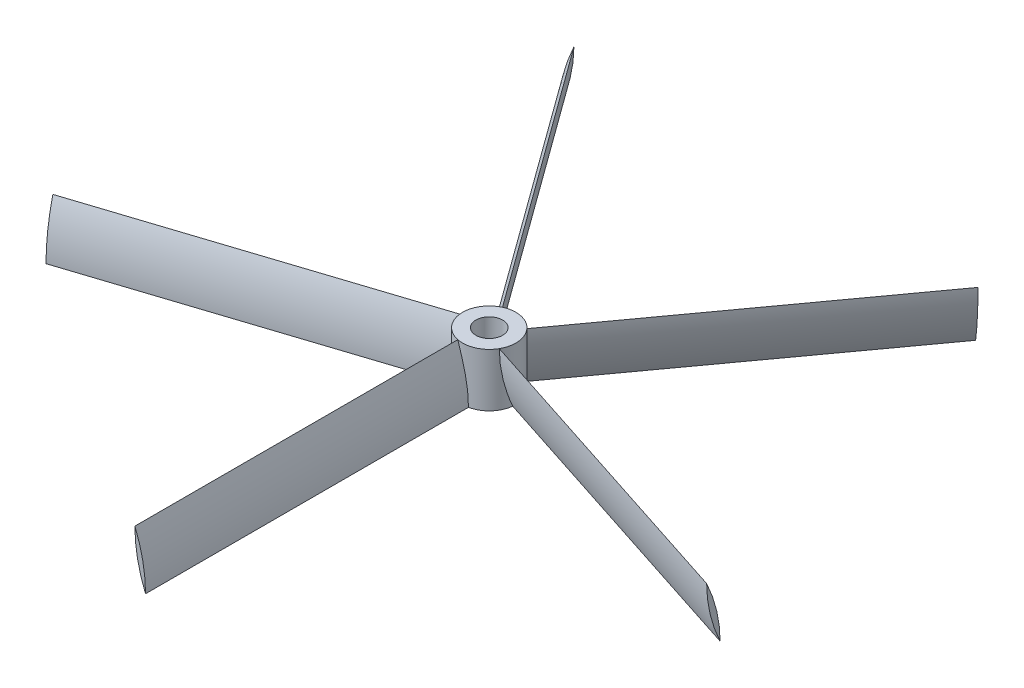
ISO-10303-21;
HEADER;
FILE_DESCRIPTION(('STEP AP214'),'2;1');
FILE_NAME('part.step','',(''),(''),'','','');
FILE_SCHEMA(('AUTOMOTIVE_DESIGN { 1 0 10303 214 1 1 1 1 }'));
ENDSEC;
DATA;
#1=APPLICATION_CONTEXT('core data for automotive mechanical design processes');
#2=APPLICATION_PROTOCOL_DEFINITION('international standard','automotive_design',2000,#1);
#3=PRODUCT_CONTEXT('',#1,'mechanical');
#4=PRODUCT('Part','Part','',(#3));
#5=PRODUCT_RELATED_PRODUCT_CATEGORY('part','',(#4));
#6=PRODUCT_DEFINITION_FORMATION('','',#4);
#7=PRODUCT_DEFINITION_CONTEXT('part definition',#1,'design');
#8=PRODUCT_DEFINITION('design','',#6,#7);
#9=PRODUCT_DEFINITION_SHAPE('','',#8);
#10=(LENGTH_UNIT() NAMED_UNIT(*) SI_UNIT(.MILLI.,.METRE.));
#11=(NAMED_UNIT(*) PLANE_ANGLE_UNIT() SI_UNIT($,.RADIAN.));
#12=(NAMED_UNIT(*) SI_UNIT($,.STERADIAN.) SOLID_ANGLE_UNIT());
#13=UNCERTAINTY_MEASURE_WITH_UNIT(LENGTH_MEASURE(1.E-05),#10,'distance_accuracy_value','');
#14=(GEOMETRIC_REPRESENTATION_CONTEXT(3) GLOBAL_UNCERTAINTY_ASSIGNED_CONTEXT((#13)) GLOBAL_UNIT_ASSIGNED_CONTEXT((#10,
#11,#12)) REPRESENTATION_CONTEXT('',''));
#15=CARTESIAN_POINT('',(0.,0.,0.));
#16=DIRECTION('',(0.,0.,1.));
#17=DIRECTION('',(1.,0.,0.));
#18=AXIS2_PLACEMENT_3D('',#15,#16,#17);
#19=CARTESIAN_POINT('',(0.,10.,0.));
#20=DIRECTION('',(0.,-1.,0.));
#21=DIRECTION('',(0.,0.,-1.));
#22=AXIS2_PLACEMENT_3D('',#19,#20,#21);
#23=CYLINDRICAL_SURFACE('',#22,5.);
#24=CARTESIAN_POINT('',(-4.35018936856919,0.,2.46492443242944));
#25=CARTESIAN_POINT('',(-4.35018576242669,0.183122408193911,2.46492327211694));
#26=CARTESIAN_POINT('',(-4.35116329032223,0.366238966577232,2.46320659108679));
#27=CARTESIAN_POINT('',(-4.35504861769024,0.732385126654451,2.45633344970384));
#28=CARTESIAN_POINT('',(-4.35795639685755,0.915414729242806,2.45117702553521));
#29=CARTESIAN_POINT('',(-4.36952652783202,1.46423654088765,2.43053608567267));
#30=CARTESIAN_POINT('',(-4.3810356828564,1.82979126387575,2.40987990521031));
#31=CARTESIAN_POINT('',(-4.41100473200378,2.56002603892125,2.35457445252717));
#32=CARTESIAN_POINT('',(-4.42947377498104,2.92470430108329,2.31990675763802));
#33=CARTESIAN_POINT('',(-4.47226728840418,3.65207369386719,2.23629846711075));
#34=CARTESIAN_POINT('',(-4.49659168812454,4.01476484843675,2.18735804386812));
#35=CARTESIAN_POINT('',(-4.54912950127679,4.73094342097573,2.07584844477526));
#36=CARTESIAN_POINT('',(-4.57726379887104,5.08447797468368,2.01354442228804));
#37=CARTESIAN_POINT('',(-4.63599991386565,5.78845761718897,1.87435626582235));
#38=CARTESIAN_POINT('',(-4.66660168189557,6.13890276764517,1.79747242352305));
#39=CARTESIAN_POINT('',(-4.72815660226076,6.83573916802041,1.62867946904067));
#40=CARTESIAN_POINT('',(-4.75910935682641,7.18213424879246,1.53678603815932));
#41=CARTESIAN_POINT('',(-4.81896112487492,7.87051902716679,1.3373339739789));
#42=CARTESIAN_POINT('',(-4.84786061668544,8.21250973551101,1.22977900710991));
#43=CARTESIAN_POINT('',(-4.88380287649291,8.67383406860872,1.07251073141029));
#44=CARTESIAN_POINT('',(-4.89298665612179,8.7954458951682,1.02988631705044));
#45=CARTESIAN_POINT('',(-4.91056720210785,9.03794972524256,0.942506075061072));
#46=CARTESIAN_POINT('',(-4.91896403569518,9.1588417894201,0.897750429999793));
#47=CARTESIAN_POINT('',(-4.93484128986999,9.40025583629768,0.805928129437622));
#48=CARTESIAN_POINT('',(-4.94231865626409,9.52077535457646,0.758854462608985));
#49=CARTESIAN_POINT('',(-4.95615400359151,9.76100921267716,0.662496655488868));
#50=CARTESIAN_POINT('',(-4.96251184519309,9.88072345049625,0.61321224101263));
#51=CARTESIAN_POINT('',(-4.9682233573191,10.,0.562811399839151));
#52=B_SPLINE_CURVE_WITH_KNOTS('',3,(#24,#25,#26,#27,#28,#29,#30,#31,#32,#33,#34,#35,#36,#37,#38,
#39,#40,#41,#42,#43,#44,#45,#46,#47,#48,#49,#50,#51),.UNSPECIFIED.,.F.,.F.,(4,2,2,2,2,2,2,2,2,2,
2,2,2,4),(0.,0.549344934541571,1.09868409037402,2.19727394631187,3.29731297760975,
4.39733872245518,5.47727983444197,6.55719934375528,7.63599773777188,8.71454398546223,
9.1021046483874,9.48963217110426,9.87841403301756,10.2672442470775),.UNSPECIFIED.);
#53=CARTESIAN_POINT('',(-4.35018936856919,0.,2.46492443242944));
#54=VERTEX_POINT('',#53);
#55=CARTESIAN_POINT('',(-4.96822335731911,10.,0.56281139983914));
#56=VERTEX_POINT('',#55);
#57=EDGE_CURVE('E142',#54,#56,#52,.T.);
#58=ORIENTED_EDGE('',*,*,#57,.F.);
#59=CARTESIAN_POINT('',(0.,0.,0.));
#60=DIRECTION('',(0.,1.,0.));
#61=DIRECTION('',(0.,0.,1.));
#62=AXIS2_PLACEMENT_3D('',#59,#60,#61);
#63=CIRCLE('',#62,5.);
#64=CARTESIAN_POINT('',(0.999999999999997,0.,4.89897948556636));
#65=VERTEX_POINT('',#64);
#66=EDGE_CURVE('E393',#54,#65,#63,.T.);
#67=ORIENTED_EDGE('',*,*,#66,.T.);
#68=CARTESIAN_POINT('',(-1.,10.,4.89897948556636));
#69=CARTESIAN_POINT('',(-1.00000001083655,9.81687759180609,4.89897569736476));
#70=CARTESIAN_POINT('',(-0.998065277424227,9.63376103342277,4.89937489802743));
#71=CARTESIAN_POINT('',(-0.990327899339134,9.26761487334555,4.90094614644664));
#72=CARTESIAN_POINT('',(-0.984525295354193,9.0845852707572,4.90211818607334));
#73=CARTESIAN_POINT('',(-0.961319227897217,8.53576345911235,4.90674363333361));
#74=CARTESIAN_POINT('',(-0.938117508373282,8.17020873612425,4.91130637941485));
#75=CARTESIAN_POINT('',(-0.876257951720518,7.43997396107875,4.92271831413295));
#76=CARTESIAN_POINT('',(-0.837579766441451,7.07529569891671,4.92957051092965));
#77=CARTESIAN_POINT('',(-0.744839634022431,6.34792630613281,4.94443317808232));
#78=CARTESIAN_POINT('',(-0.690777872695728,5.98523515156324,4.95244363444747));
#79=CARTESIAN_POINT('',(-0.568490864737664,5.26905657902427,4.96795170284218));
#80=CARTESIAN_POINT('',(-0.500542242078362,4.91552202531632,4.9754560081341));
#81=CARTESIAN_POINT('',(-0.350015981163668,4.21154238281102,4.98830586727798));
#82=CARTESIAN_POINT('',(-0.267438635567945,3.86109723235483,4.99365146430966));
#83=CARTESIAN_POINT('',(-0.0878854798225153,3.16426083197959,5.00003378096719));
#84=CARTESIAN_POINT('',(0.00907529360542183,2.81786575120754,5.00107496808037));
#85=CARTESIAN_POINT('',(0.217260692403102,2.12948097283321,4.99636330469978));
#86=CARTESIAN_POINT('',(0.328481978602005,1.78749026448899,4.99061204211184));
#87=CARTESIAN_POINT('',(0.489159766109385,1.32616593139128,4.97619659264488));
#88=CARTESIAN_POINT('',(0.532535937117506,1.2045541048318,4.97175921769267));
#89=CARTESIAN_POINT('',(0.621072173137027,0.962050274757444,4.96147733076543));
#90=CARTESIAN_POINT('',(0.666232085290968,0.84115821057991,4.95563293914675));
#91=CARTESIAN_POINT('',(0.758466623945855,0.599744163702327,4.94235845385427));
#92=CARTESIAN_POINT('',(0.80554697481808,0.479224645423545,4.9349232888505));
#93=CARTESIAN_POINT('',(0.901464052622833,0.23899078732285,4.91830528614063));
#94=CARTESIAN_POINT('',(0.950300997264684,0.119276549503763,4.90912223119442));
#95=CARTESIAN_POINT('',(0.999999999999996,0.,4.89897948556636));
#96=B_SPLINE_CURVE_WITH_KNOTS('',3,(#68,#69,#70,#71,#72,#73,#74,#75,#76,#77,#78,#79,#80,#81,#82,
#83,#84,#85,#86,#87,#88,#89,#90,#91,#92,#93,#94,#95),.UNSPECIFIED.,.F.,.F.,(4,2,2,2,2,2,2,2,2,2,
2,2,2,4),(0.,0.549344934541571,1.09868409037402,2.19727394631186,3.29731297760975,
4.39733872245518,5.47727983444197,6.55719934375529,7.63599773777188,8.71454398546223,
9.10210464838739,9.48963217110426,9.87841403301756,10.2672442470775),.UNSPECIFIED.);
#97=CARTESIAN_POINT('',(-1.,10.,4.89897948556636));
#98=VERTEX_POINT('',#97);
#99=EDGE_CURVE('E53',#98,#65,#96,.T.);
#100=ORIENTED_EDGE('',*,*,#99,.F.);
#101=CARTESIAN_POINT('',(0.,10.,0.));
#102=DIRECTION('',(0.,1.,0.));
#103=DIRECTION('',(0.,0.,1.));
#104=AXIS2_PLACEMENT_3D('',#101,#102,#103);
#105=CIRCLE('',#104,5.);
#106=EDGE_CURVE('E233',#56,#98,#105,.T.);
#107=ORIENTED_EDGE('',*,*,#106,.F.);
#108=EDGE_LOOP('',(#58,#67,#100,#107));
#109=FACE_BOUND('',#108,.T.);
#110=ADVANCED_FACE('F39',(#109),#23,.T.);
#111=CARTESIAN_POINT('',(-4.96822335731911,10.,0.56281139983914));
#112=CARTESIAN_POINT('',(-4.96821975787397,9.81687759180609,0.562810218914301));
#113=CARTESIAN_POINT('',(-4.96800155476152,9.63376103342277,0.564773619522319));
#114=CARTESIAN_POINT('',(-4.96710491948913,9.26761487334555,0.572617845833107));
#115=CARTESIAN_POINT('',(-4.96642649217048,9.0845852707572,0.578498630327197));
#116=CARTESIAN_POINT('',(-4.96365448471132,8.53576345911235,0.601998253809744));
#117=CARTESIAN_POINT('',(-4.96082418847247,8.17020873612425,0.625474366432354));
#118=CARTESIAN_POINT('',(-4.95256192907945,7.43997396107875,0.687832782648684));
#119=CARTESIAN_POINT('',(-4.94712653893108,7.07529569891671,0.726735368055797));
#120=CARTESIAN_POINT('',(-4.93260349839809,6.34792630613281,0.819529292046894));
#121=CARTESIAN_POINT('',(-4.92351589212687,5.98523515156324,0.873420449588577));
#122=CARTESIAN_POINT('',(-4.9004761779785,5.26905657902427,0.994514562049227));
#123=CARTESIAN_POINT('',(-4.88661591728055,4.91552202531632,1.06145650026882));
#124=CARTESIAN_POINT('',(-4.85232168683045,4.21154238281103,1.20858630643607));
#125=CARTESIAN_POINT('',(-4.83188784858146,3.86109723235483,1.2887739093911));
#126=CARTESIAN_POINT('',(-4.78247281590867,3.16426083197959,1.46151135249481));
#127=CARTESIAN_POINT('',(-4.75350051692038,2.81786575120754,1.55404827240076));
#128=CARTESIAN_POINT('',(-4.68468663255047,2.12948097283321,1.75058836846842));
#129=CARTESIAN_POINT('',(-4.64484758921758,1.78749026448899,1.85458885957984));
#130=CARTESIAN_POINT('',(-4.58148551510836,1.32616593139128,2.00294789754577));
#131=CARTESIAN_POINT('',(-4.56386134675239,1.2045541048318,2.04282986336433));
#132=CARTESIAN_POINT('',(-4.5267234896424,0.962050274757444,2.12385554976418));
#133=CARTESIAN_POINT('',(-4.50720996258963,0.841158210579908,2.16499916216155));
#134=CARTESIAN_POINT('',(-4.46608313693905,0.599744163702327,2.2486173796298));
#135=CARTESIAN_POINT('',(-4.44446324629184,0.479224645423546,2.29109586177415));
#136=CARTESIAN_POINT('',(-4.39901857943435,0.238990787322853,2.37718317839443));
#137=CARTESIAN_POINT('',(-4.37519352934058,0.119276549503765,2.42079215279335));
#138=CARTESIAN_POINT('',(-4.35018936856919,0.,2.46492443242944));
#139=B_SPLINE_CURVE_WITH_KNOTS('',3,(#111,#112,#113,#114,#115,#116,#117,#118,#119,#120,#121,
#122,#123,#124,#125,#126,#127,#128,#129,#130,#131,#132,#133,#134,#135,#136,#137,#138),
.UNSPECIFIED.,.F.,.F.,(4,2,2,2,2,2,2,2,2,2,2,2,2,4),(0.,0.549344934541571,1.09868409037402,
2.19727394631187,3.29731297760975,4.39733872245518,5.47727983444197,6.55719934375529,
7.63599773777188,8.71454398546223,9.10210464838739,9.48963217110426,9.87841403301756,
10.2672442470775),.UNSPECIFIED.);
#140=EDGE_CURVE('E60',#56,#54,#139,.T.);
#141=ORIENTED_EDGE('',*,*,#140,.F.);
#142=CARTESIAN_POINT('',(-2.07053089852436,10.,-4.55114291120988));
#143=VERTEX_POINT('',#142);
#144=EDGE_CURVE('E384',#143,#56,#105,.T.);
#145=ORIENTED_EDGE('',*,*,#144,.F.);
#146=CARTESIAN_POINT('',(-3.68856488727425,0.,-3.37557240662492));
#147=CARTESIAN_POINT('',(-3.68856266939217,0.183122408193911,-3.37556933553588));
#148=CARTESIAN_POINT('',(-3.68723208144424,0.366238966577233,-3.37702950342303));
#149=CARTESIAN_POINT('',(-3.68189596772999,0.732385126654451,-3.38284858682639));
#150=CARTESIAN_POINT('',(-3.67789047010222,0.915414729242806,-3.38720747184971));
#151=CARTESIAN_POINT('',(-3.66183513684176,1.46423654088765,-3.40458972150477));
#152=CARTESIAN_POINT('',(-3.64574646630468,1.82979126387575,-3.4219186891895));
#153=CARTESIAN_POINT('',(-3.60240880063552,2.56002603892125,-3.46751127342899));
#154=CARTESIAN_POINT('',(-3.57514511165608,2.92470430108329,-3.49578928397879));
#155=CARTESIAN_POINT('',(-3.50885282503059,3.65207369386719,-3.56232471641859));
#156=CARTESIAN_POINT('',(-3.46982436948701,4.01476484843676,-3.60058201777149));
#157=CARTESIAN_POINT('',(-3.38000751575163,4.73094342097573,-3.68500680847746));
#158=CARTESIAN_POINT('',(-3.32944684525517,5.08447797468368,-3.73101711730232));
#159=CARTESIAN_POINT('',(-3.21522149977427,5.78845761718898,-3.82988998797343));
#160=CARTESIAN_POINT('',(-3.15155708693688,6.13890276764517,-3.88275241273177));
#161=CARTESIAN_POINT('',(-3.01004696415194,6.83573916802041,-3.99345451232093));
#162=CARTESIAN_POINT('',(-2.932216045091,7.18213424879246,-4.05128896306163));
#163=CARTESIAN_POINT('',(-2.76102107323408,7.87051902716679,-4.16984545447086));
#164=CARTESIAN_POINT('',(-2.66766065523168,8.21250973551101,-4.23056681706683));
#165=CARTESIAN_POINT('',(-2.52919640591779,8.67383406860872,-4.31334850733432));
#166=CARTESIAN_POINT('',(-2.4914961228655,8.7954458951682,-4.33525446920706));
#167=CARTESIAN_POINT('',(-2.41382526180615,9.03794972524256,-4.37897654177444));
#168=CARTESIAN_POINT('',(-2.37385487820705,9.15884178942009,-4.40079265999206));
#169=CARTESIAN_POINT('',(-2.29143302228022,9.40025583629768,-4.4442674773722));
#170=CARTESIAN_POINT('',(-2.24897393798588,9.52077535457646,-4.46592543844363));
#171=CARTESIAN_POINT('',(-2.16160757507563,9.76100921267716,-4.5088598356154));
#172=CARTESIAN_POINT('',(-2.11669999263865,9.88072345049625,-4.53013622393114));
#173=CARTESIAN_POINT('',(-2.07053089852437,10.,-4.55114291120987));
#174=B_SPLINE_CURVE_WITH_KNOTS('',3,(#146,#147,#148,#149,#150,#151,#152,#153,#154,#155,#156,
#157,#158,#159,#160,#161,#162,#163,#164,#165,#166,#167,#168,#169,#170,#171,#172,#173),
.UNSPECIFIED.,.F.,.F.,(4,2,2,2,2,2,2,2,2,2,2,2,2,4),(0.,0.549344934541571,1.09868409037402,
2.19727394631187,3.29731297760975,4.39733872245518,5.47727983444197,6.55719934375529,
7.63599773777188,8.71454398546223,9.10210464838739,9.48963217110426,9.87841403301756,
10.2672442470775),.UNSPECIFIED.);
#175=CARTESIAN_POINT('',(-3.68856488727425,0.,-3.37557240662492));
#176=VERTEX_POINT('',#175);
#177=EDGE_CURVE('E318',#176,#143,#174,.T.);
#178=ORIENTED_EDGE('',*,*,#177,.F.);
#179=EDGE_CURVE('E382',#176,#54,#63,.T.);
#180=ORIENTED_EDGE('',*,*,#179,.T.);
#181=EDGE_LOOP('',(#141,#145,#178,#180));
#182=FACE_BOUND('',#181,.T.);
#183=ADVANCED_FACE('F182',(#182),#23,.T.);
#184=CARTESIAN_POINT('',(-2.07053089852436,10.,-4.55114291120988));
#185=CARTESIAN_POINT('',(-2.07052866310837,9.81687759180609,-4.55113985285997));
#186=CARTESIAN_POINT('',(-2.07232853958076,9.63376103342277,-4.55032560521336));
#187=CARTESIAN_POINT('',(-2.079511766592,9.26761487334555,-4.54704885515705));
#188=CARTESIAN_POINT('',(-2.08489507943513,9.0845852707572,-4.54458637008589));
#189=CARTESIAN_POINT('',(-2.10638795206528,8.53576345911235,-4.53468825131111));
#190=CARTESIAN_POINT('',(-2.12784045231536,8.17020873612425,-4.52474196186786));
#191=CARTESIAN_POINT('',(-2.18459365183937,7.43997396107875,-4.49761427587966));
#192=CARTESIAN_POINT('',(-2.21991258126463,7.07529569891671,-4.48042335264452));
#193=CARTESIAN_POINT('',(-2.30367698101427,6.34792630613281,-4.43793622082122));
#194=CARTESIAN_POINT('',(-2.35212229278898,5.98523515156324,-4.41264011013253));
#195=CARTESIAN_POINT('',(-2.46016997431227,5.26905657902427,-4.35330790118905));
#196=CARTESIAN_POINT('',(-2.51955248476732,4.91552202531632,-4.31943981338847));
#197=CARTESIAN_POINT('',(-2.64888374564583,4.21154238281102,-4.2413584515628));
#198=CARTESIAN_POINT('',(-2.71883228468305,3.86109723235483,-4.19714538449189));
#199=CARTESIAN_POINT('',(-2.86784527068151,3.16426083197959,-4.09677009018157));
#200=CARTESIAN_POINT('',(-2.94690017860246,2.81786575120754,-4.04062031557865));
#201=CARTESIAN_POINT('',(-3.11255625796163,2.12948097283321,-3.91444019267607));
#202=CARTESIAN_POINT('',(-3.19915566130152,1.78749026448899,-3.8444130917346));
#203=CARTESIAN_POINT('',(-3.32067353341172,1.32616593139128,-3.73830671426645));
#204=CARTESIAN_POINT('',(-3.3531573693524,1.2045541048318,-3.70922092890021));
#205=CARTESIAN_POINT('',(-3.41874114740861,0.962050274757447,-3.64886241381606));
#206=CARTESIAN_POINT('',(-3.45184103660355,0.841158210579912,-3.61758987131586));
#207=CARTESIAN_POINT('',(-3.51865779915699,0.59974416370233,-3.55263648554932));
#208=CARTESIAN_POINT('',(-3.55237632277618,0.479224645423547,-3.51894817478985));
#209=CARTESIAN_POINT('',(-3.62020705185559,0.238990787322852,-3.44912528440837));
#210=CARTESIAN_POINT('',(-3.65431930575582,0.119276549503763,-3.4129904010691));
#211=CARTESIAN_POINT('',(-3.68856488727425,0.,-3.37557240662492));
#212=B_SPLINE_CURVE_WITH_KNOTS('',3,(#184,#185,#186,#187,#188,#189,#190,#191,#192,#193,#194,
#195,#196,#197,#198,#199,#200,#201,#202,#203,#204,#205,#206,#207,#208,#209,#210,#211),
.UNSPECIFIED.,.F.,.F.,(4,2,2,2,2,2,2,2,2,2,2,2,2,4),(0.,0.549344934541571,1.09868409037402,
2.19727394631186,3.29731297760975,4.39733872245518,5.47727983444197,6.55719934375529,
7.63599773777188,8.71454398546223,9.10210464838739,9.48963217110426,9.87841403301756,
10.2672442470775),.UNSPECIFIED.);
#213=EDGE_CURVE('E68',#143,#176,#212,.T.);
#214=ORIENTED_EDGE('',*,*,#213,.F.);
#215=CARTESIAN_POINT('',(3.6885648872742,10.,-3.37557240662497));
#216=VERTEX_POINT('',#215);
#217=EDGE_CURVE('E229',#216,#143,#105,.T.);
#218=ORIENTED_EDGE('',*,*,#217,.F.);
#219=CARTESIAN_POINT('',(2.0705308985243,0.,-4.5511429112099));
#220=CARTESIAN_POINT('',(2.07052866310832,0.18312240819391,-4.55113985285999));
#221=CARTESIAN_POINT('',(2.0723285395807,0.366238966577232,-4.55032560521338));
#222=CARTESIAN_POINT('',(2.07951176659194,0.73238512665445,-4.54704885515708));
#223=CARTESIAN_POINT('',(2.08489507943507,0.915414729242805,-4.54458637008592));
#224=CARTESIAN_POINT('',(2.10638795206521,1.46423654088765,-4.53468825131115));
#225=CARTESIAN_POINT('',(2.1278404523153,1.82979126387575,-4.52474196186789));
#226=CARTESIAN_POINT('',(2.18459365183931,2.56002603892125,-4.49761427587969));
#227=CARTESIAN_POINT('',(2.21991258126457,2.92470430108329,-4.48042335264455));
#228=CARTESIAN_POINT('',(2.30367698101421,3.65207369386719,-4.43793622082125));
#229=CARTESIAN_POINT('',(2.35212229278892,4.01476484843675,-4.41264011013256));
#230=CARTESIAN_POINT('',(2.46016997431221,4.73094342097573,-4.35330790118909));
#231=CARTESIAN_POINT('',(2.51955248476725,5.08447797468368,-4.31943981338851));
#232=CARTESIAN_POINT('',(2.64888374564576,5.78845761718898,-4.24135845156284));
#233=CARTESIAN_POINT('',(2.71883228468299,6.13890276764517,-4.19714538449193));
#234=CARTESIAN_POINT('',(2.86784527068145,6.83573916802041,-4.09677009018162));
#235=CARTESIAN_POINT('',(2.94690017860239,7.18213424879246,-4.04062031557869));
#236=CARTESIAN_POINT('',(3.11255625796156,7.8705190271668,-3.91444019267612));
#237=CARTESIAN_POINT('',(3.19915566130146,8.21250973551101,-3.84441309173465));
#238=CARTESIAN_POINT('',(3.32067353341166,8.67383406860872,-3.7383067142665));
#239=CARTESIAN_POINT('',(3.35315736935235,8.7954458951682,-3.70922092890026));
#240=CARTESIAN_POINT('',(3.41874114740856,9.03794972524256,-3.64886241381612));
#241=CARTESIAN_POINT('',(3.45184103660349,9.1588417894201,-3.61758987131592));
#242=CARTESIAN_POINT('',(3.51865779915693,9.40025583629768,-3.55263648554938));
#243=CARTESIAN_POINT('',(3.55237632277613,9.52077535457646,-3.5189481747899));
#244=CARTESIAN_POINT('',(3.62020705185554,9.76100921267716,-3.44912528440843));
#245=CARTESIAN_POINT('',(3.65431930575577,9.88072345049625,-3.41299040106915));
#246=CARTESIAN_POINT('',(3.68856488727419,10.,-3.37557240662497));
#247=B_SPLINE_CURVE_WITH_KNOTS('',3,(#219,#220,#221,#222,#223,#224,#225,#226,#227,#228,#229,
#230,#231,#232,#233,#234,#235,#236,#237,#238,#239,#240,#241,#242,#243,#244,#245,#246),
.UNSPECIFIED.,.F.,.F.,(4,2,2,2,2,2,2,2,2,2,2,2,2,4),(0.,0.54934493454157,1.09868409037402,
2.19727394631186,3.29731297760974,4.39733872245518,5.47727983444197,6.55719934375529,
7.63599773777188,8.71454398546223,9.10210464838739,9.48963217110426,9.87841403301756,
10.2672442470775),.UNSPECIFIED.);
#248=CARTESIAN_POINT('',(2.0705308985243,0.,-4.5511429112099));
#249=VERTEX_POINT('',#248);
#250=EDGE_CURVE('E217',#249,#216,#247,.T.);
#251=ORIENTED_EDGE('',*,*,#250,.F.);
#252=EDGE_CURVE('E341',#249,#176,#63,.T.);
#253=ORIENTED_EDGE('',*,*,#252,.T.);
#254=EDGE_LOOP('',(#214,#218,#251,#253));
#255=FACE_BOUND('',#254,.T.);
#256=ADVANCED_FACE('F188',(#255),#23,.T.);
#257=CARTESIAN_POINT('',(3.6885648872742,10.,-3.37557240662496));
#258=CARTESIAN_POINT('',(3.68856266939213,9.81687759180609,-3.37556933553592));
#259=CARTESIAN_POINT('',(3.6872320814442,9.63376103342277,-3.37702950342308));
#260=CARTESIAN_POINT('',(3.68189596772995,9.26761487334555,-3.38284858682643));
#261=CARTESIAN_POINT('',(3.67789047010218,9.08458527075719,-3.38720747184976));
#262=CARTESIAN_POINT('',(3.66183513684171,8.53576345911235,-3.40458972150482));
#263=CARTESIAN_POINT('',(3.64574646630463,8.17020873612425,-3.42191868918955));
#264=CARTESIAN_POINT('',(3.60240880063548,7.43997396107875,-3.46751127342904));
#265=CARTESIAN_POINT('',(3.57514511165604,7.07529569891671,-3.49578928397884));
#266=CARTESIAN_POINT('',(3.50885282503054,6.34792630613281,-3.56232471641864));
#267=CARTESIAN_POINT('',(3.46982436948695,5.98523515156325,-3.60058201777154));
#268=CARTESIAN_POINT('',(3.38000751575157,5.26905657902427,-3.68500680847751));
#269=CARTESIAN_POINT('',(3.32944684525511,4.91552202531632,-3.73101711730238));
#270=CARTESIAN_POINT('',(3.21522149977422,4.21154238281102,-3.82988998797348));
#271=CARTESIAN_POINT('',(3.15155708693682,3.86109723235483,-3.88275241273181));
#272=CARTESIAN_POINT('',(3.01004696415187,3.16426083197959,-3.99345451232097));
#273=CARTESIAN_POINT('',(2.93221604509094,2.81786575120754,-4.05128896306167));
#274=CARTESIAN_POINT('',(2.76102107323401,2.12948097283321,-4.1698454544709));
#275=CARTESIAN_POINT('',(2.66766065523161,1.78749026448899,-4.23056681706686));
#276=CARTESIAN_POINT('',(2.52919640591772,1.32616593139128,-4.31334850733436));
#277=CARTESIAN_POINT('',(2.49149612286544,1.2045541048318,-4.3352544692071));
#278=CARTESIAN_POINT('',(2.41382526180608,0.962050274757447,-4.37897654177448));
#279=CARTESIAN_POINT('',(2.37385487820698,0.841158210579912,-4.4007926599921));
#280=CARTESIAN_POINT('',(2.29143302228015,0.599744163702328,-4.44426747737224));
#281=CARTESIAN_POINT('',(2.24897393798582,0.479224645423544,-4.46592543844366));
#282=CARTESIAN_POINT('',(2.16160757507557,0.238990787322848,-4.50885983561543));
#283=CARTESIAN_POINT('',(2.11669999263859,0.119276549503761,-4.53013622393116));
#284=CARTESIAN_POINT('',(2.0705308985243,0.,-4.5511429112099));
#285=B_SPLINE_CURVE_WITH_KNOTS('',3,(#257,#258,#259,#260,#261,#262,#263,#264,#265,#266,#267,
#268,#269,#270,#271,#272,#273,#274,#275,#276,#277,#278,#279,#280,#281,#282,#283,#284),
.UNSPECIFIED.,.F.,.F.,(4,2,2,2,2,2,2,2,2,2,2,2,2,4),(0.,0.549344934541571,1.09868409037403,
2.19727394631186,3.29731297760974,4.39733872245518,5.47727983444197,6.55719934375529,
7.63599773777188,8.71454398546223,9.10210464838739,9.48963217110426,9.87841403301756,
10.2672442470775),.UNSPECIFIED.);
#286=EDGE_CURVE('E225',#216,#249,#285,.T.);
#287=ORIENTED_EDGE('',*,*,#286,.F.);
#288=CARTESIAN_POINT('',(4.35018936856922,10.,2.46492443242939));
#289=VERTEX_POINT('',#288);
#290=EDGE_CURVE('E221',#289,#216,#105,.T.);
#291=ORIENTED_EDGE('',*,*,#290,.F.);
#292=CARTESIAN_POINT('',(4.96822335731911,0.,0.562811399839077));
#293=CARTESIAN_POINT('',(4.96821975787397,0.183122408193911,0.562810218914232));
#294=CARTESIAN_POINT('',(4.96800155476153,0.366238966577232,0.564773619522249));
#295=CARTESIAN_POINT('',(4.96710491948914,0.73238512665445,0.572617845833041));
#296=CARTESIAN_POINT('',(4.96642649217049,0.915414729242805,0.578498630327135));
#297=CARTESIAN_POINT('',(4.96365448471133,1.46423654088765,0.601998253809688));
#298=CARTESIAN_POINT('',(4.96082418847247,1.82979126387575,0.625474366432294));
#299=CARTESIAN_POINT('',(4.95256192907946,2.56002603892125,0.687832782648619));
#300=CARTESIAN_POINT('',(4.94712653893109,2.92470430108329,0.726735368055731));
#301=CARTESIAN_POINT('',(4.9326034983981,3.65207369386719,0.81952929204683));
#302=CARTESIAN_POINT('',(4.92351589212688,4.01476484843675,0.873420449588515));
#303=CARTESIAN_POINT('',(4.90047617797851,4.73094342097573,0.994514562049163));
#304=CARTESIAN_POINT('',(4.88661591728057,5.08447797468368,1.06145650026875));
#305=CARTESIAN_POINT('',(4.85232168683047,5.78845761718898,1.20858630643599));
#306=CARTESIAN_POINT('',(4.83188784858148,6.13890276764517,1.28877390939103));
#307=CARTESIAN_POINT('',(4.7824728159087,6.83573916802041,1.46151135249474));
#308=CARTESIAN_POINT('',(4.7535005169204,7.18213424879246,1.55404827240069));
#309=CARTESIAN_POINT('',(4.68468663255049,7.8705190271668,1.75058836846835));
#310=CARTESIAN_POINT('',(4.64484758921761,8.21250973551101,1.85458885957977));
#311=CARTESIAN_POINT('',(4.58148551510839,8.67383406860872,2.0029478975457));
#312=CARTESIAN_POINT('',(4.56386134675242,8.7954458951682,2.04282986336426));
#313=CARTESIAN_POINT('',(4.52672348964243,9.03794972524256,2.12385554976412));
#314=CARTESIAN_POINT('',(4.50720996258966,9.1588417894201,2.16499916216148));
#315=CARTESIAN_POINT('',(4.46608313693909,9.40025583629768,2.24861737962973));
#316=CARTESIAN_POINT('',(4.44446324629188,9.52077535457646,2.29109586177408));
#317=CARTESIAN_POINT('',(4.39901857943439,9.76100921267716,2.37718317839436));
#318=CARTESIAN_POINT('',(4.37519352934062,9.88072345049625,2.42079215279328));
#319=CARTESIAN_POINT('',(4.35018936856923,10.,2.46492443242938));
#320=B_SPLINE_CURVE_WITH_KNOTS('',3,(#292,#293,#294,#295,#296,#297,#298,#299,#300,#301,#302,
#303,#304,#305,#306,#307,#308,#309,#310,#311,#312,#313,#314,#315,#316,#317,#318,#319),
.UNSPECIFIED.,.F.,.F.,(4,2,2,2,2,2,2,2,2,2,2,2,2,4),(0.,0.54934493454157,1.09868409037402,
2.19727394631186,3.29731297760974,4.39733872245518,5.47727983444197,6.55719934375529,
7.63599773777188,8.71454398546223,9.10210464838739,9.48963217110426,9.87841403301756,
10.2672442470775),.UNSPECIFIED.);
#321=CARTESIAN_POINT('',(4.96822335731911,0.,0.562811399839077));
#322=VERTEX_POINT('',#321);
#323=EDGE_CURVE('E223',#322,#289,#320,.T.);
#324=ORIENTED_EDGE('',*,*,#323,.F.);
#325=EDGE_CURVE('E392',#322,#249,#63,.T.);
#326=ORIENTED_EDGE('',*,*,#325,.T.);
#327=EDGE_LOOP('',(#287,#291,#324,#326));
#328=FACE_BOUND('',#327,.T.);
#329=ADVANCED_FACE('F191',(#328),#23,.T.);
#330=CARTESIAN_POINT('',(4.35018936856922,10.,2.46492443242939));
#331=CARTESIAN_POINT('',(4.35018576242673,9.81687759180609,2.46492327211688));
#332=CARTESIAN_POINT('',(4.35116329032227,9.63376103342277,2.46320659108673));
#333=CARTESIAN_POINT('',(4.35504861769028,9.26761487334555,2.45633344970378));
#334=CARTESIAN_POINT('',(4.35795639685758,9.0845852707572,2.45117702553515));
#335=CARTESIAN_POINT('',(4.36952652783205,8.53576345911235,2.43053608567261));
#336=CARTESIAN_POINT('',(4.38103568285643,8.17020873612425,2.40987990521025));
#337=CARTESIAN_POINT('',(4.41100473200382,7.43997396107875,2.3545744525271));
#338=CARTESIAN_POINT('',(4.42947377498108,7.07529569891671,2.31990675763795));
#339=CARTESIAN_POINT('',(4.47226728840421,6.34792630613281,2.23629846711068));
#340=CARTESIAN_POINT('',(4.49659168812458,5.98523515156325,2.18735804386806));
#341=CARTESIAN_POINT('',(4.54912950127682,5.26905657902427,2.0758484447752));
#342=CARTESIAN_POINT('',(4.57726379887107,4.91552202531632,2.01354442228797));
#343=CARTESIAN_POINT('',(4.63599991386568,4.21154238281102,1.87435626582229));
#344=CARTESIAN_POINT('',(4.6666016818956,3.86109723235483,1.79747242352299));
#345=CARTESIAN_POINT('',(4.72815660226079,3.16426083197959,1.6286794690406));
#346=CARTESIAN_POINT('',(4.75910935682643,2.81786575120754,1.53678603815924));
#347=CARTESIAN_POINT('',(4.81896112487494,2.12948097283321,1.33733397397883));
#348=CARTESIAN_POINT('',(4.84786061668546,1.78749026448899,1.22977900710984));
#349=CARTESIAN_POINT('',(4.88380287649293,1.32616593139128,1.07251073141022));
#350=CARTESIAN_POINT('',(4.89298665612181,1.2045541048318,1.02988631705036));
#351=CARTESIAN_POINT('',(4.91056720210787,0.962050274757445,0.94250607506099));
#352=CARTESIAN_POINT('',(4.91896403569519,0.841158210579911,0.897750429999715));
#353=CARTESIAN_POINT('',(4.93484128987,0.599744163702329,0.805928129437549));
#354=CARTESIAN_POINT('',(4.9423186562641,0.479224645423546,0.758854462608912));
#355=CARTESIAN_POINT('',(4.95615400359152,0.238990787322851,0.662496655488796));
#356=CARTESIAN_POINT('',(4.9625118451931,0.119276549503763,0.613212241012558));
#357=CARTESIAN_POINT('',(4.96822335731911,0.,0.562811399839078));
#358=B_SPLINE_CURVE_WITH_KNOTS('',3,(#330,#331,#332,#333,#334,#335,#336,#337,#338,#339,#340,
#341,#342,#343,#344,#345,#346,#347,#348,#349,#350,#351,#352,#353,#354,#355,#356,#357),
.UNSPECIFIED.,.F.,.F.,(4,2,2,2,2,2,2,2,2,2,2,2,2,4),(0.,0.549344934541571,1.09868409037402,
2.19727394631186,3.29731297760974,4.39733872245518,5.47727983444197,6.55719934375529,
7.63599773777188,8.71454398546223,9.10210464838739,9.48963217110426,9.87841403301756,
10.2672442470775),.UNSPECIFIED.);
#359=EDGE_CURVE('E203',#289,#322,#358,.T.);
#360=ORIENTED_EDGE('',*,*,#359,.F.);
#361=EDGE_CURVE('E207',#98,#289,#105,.T.);
#362=ORIENTED_EDGE('',*,*,#361,.F.);
#363=CARTESIAN_POINT('',(0.999999999999997,0.,4.89897948556636));
#364=CARTESIAN_POINT('',(1.00000001083655,0.18312240819391,4.89897569736476));
#365=CARTESIAN_POINT('',(0.998065277424226,0.366238966577232,4.89937489802743));
#366=CARTESIAN_POINT('',(0.990327899339128,0.73238512665445,4.90094614644664));
#367=CARTESIAN_POINT('',(0.984525295354181,0.915414729242805,4.90211818607334));
#368=CARTESIAN_POINT('',(0.961319227897202,1.46423654088765,4.90674363333361));
#369=CARTESIAN_POINT('',(0.938117508373276,1.82979126387575,4.91130637941485));
#370=CARTESIAN_POINT('',(0.87625795172052,2.56002603892125,4.92271831413295));
#371=CARTESIAN_POINT('',(0.837579766441449,2.92470430108329,4.92957051092965));
#372=CARTESIAN_POINT('',(0.744839634022426,3.65207369386719,4.94443317808232));
#373=CARTESIAN_POINT('',(0.690777872695724,4.01476484843675,4.95244363444747));
#374=CARTESIAN_POINT('',(0.568490864737662,4.73094342097573,4.96795170284218));
#375=CARTESIAN_POINT('',(0.500542242078362,5.08447797468368,4.9754560081341));
#376=CARTESIAN_POINT('',(0.350015981163669,5.78845761718898,4.98830586727798));
#377=CARTESIAN_POINT('',(0.267438635567948,6.13890276764517,4.99365146430966));
#378=CARTESIAN_POINT('',(0.0878854798225192,6.83573916802041,5.00003378096719));
#379=CARTESIAN_POINT('',(-0.00907529360541825,7.18213424879246,5.00107496808037));
#380=CARTESIAN_POINT('',(-0.217260692403099,7.87051902716679,4.99636330469978));
#381=CARTESIAN_POINT('',(-0.328481978602003,8.21250973551101,4.99061204211184));
#382=CARTESIAN_POINT('',(-0.489159766109381,8.67383406860872,4.97619659264488));
#383=CARTESIAN_POINT('',(-0.532535937117502,8.7954458951682,4.97175921769267));
#384=CARTESIAN_POINT('',(-0.621072173137022,9.03794972524256,4.96147733076543));
#385=CARTESIAN_POINT('',(-0.666232085290961,9.15884178942009,4.95563293914675));
#386=CARTESIAN_POINT('',(-0.75846662394585,9.40025583629768,4.94235845385427));
#387=CARTESIAN_POINT('',(-0.805546974818077,9.52077535457646,4.9349232888505));
#388=CARTESIAN_POINT('',(-0.901464052622833,9.76100921267716,4.91830528614063));
#389=CARTESIAN_POINT('',(-0.950300997264685,9.88072345049625,4.90912223119442));
#390=CARTESIAN_POINT('',(-0.999999999999994,10.,4.89897948556636));
#391=B_SPLINE_CURVE_WITH_KNOTS('',3,(#363,#364,#365,#366,#367,#368,#369,#370,#371,#372,#373,
#374,#375,#376,#377,#378,#379,#380,#381,#382,#383,#384,#385,#386,#387,#388,#389,#390),
.UNSPECIFIED.,.F.,.F.,(4,2,2,2,2,2,2,2,2,2,2,2,2,4),(0.,0.54934493454157,1.09868409037402,
2.19727394631186,3.29731297760974,4.39733872245517,5.47727983444197,6.55719934375528,
7.63599773777188,8.71454398546223,9.10210464838739,9.48963217110426,9.87841403301756,
10.2672442470775),.UNSPECIFIED.);
#392=EDGE_CURVE('E11',#65,#98,#391,.T.);
#393=ORIENTED_EDGE('',*,*,#392,.F.);
#394=EDGE_CURVE('E209',#65,#322,#63,.T.);
#395=ORIENTED_EDGE('',*,*,#394,.T.);
#396=EDGE_LOOP('',(#360,#362,#393,#395));
#397=FACE_BOUND('',#396,.T.);
#398=ADVANCED_FACE('F184',(#397),#23,.T.);
#399=CARTESIAN_POINT('',(0.,10.,0.));
#400=DIRECTION('',(0.,1.,0.));
#401=DIRECTION('',(0.,0.,1.));
#402=AXIS2_PLACEMENT_3D('',#399,#400,#401);
#403=PLANE('',#402);
#404=ORIENTED_EDGE('',*,*,#361,.T.);
#405=ORIENTED_EDGE('',*,*,#290,.T.);
#406=ORIENTED_EDGE('',*,*,#217,.T.);
#407=ORIENTED_EDGE('',*,*,#144,.T.);
#408=ORIENTED_EDGE('',*,*,#106,.T.);
#409=EDGE_LOOP('',(#404,#405,#406,#407,#408));
#410=FACE_BOUND('',#409,.T.);
#411=CARTESIAN_POINT('',(0.,10.,0.));
#412=DIRECTION('',(0.,1.,0.));
#413=DIRECTION('',(0.,0.,1.));
#414=AXIS2_PLACEMENT_3D('',#411,#412,#413);
#415=CIRCLE('',#414,2.5);
#416=CARTESIAN_POINT('',(0.,10.,2.5));
#417=VERTEX_POINT('',#416);
#418=EDGE_CURVE('E422',#417,#417,#415,.T.);
#419=ORIENTED_EDGE('',*,*,#418,.F.);
#420=EDGE_LOOP('',(#419));
#421=FACE_BOUND('',#420,.T.);
#422=ADVANCED_FACE('F190',(#410,#421),#403,.T.);
#423=CARTESIAN_POINT('',(0.,0.,0.));
#424=DIRECTION('',(0.,1.,0.));
#425=DIRECTION('',(0.,0.,1.));
#426=AXIS2_PLACEMENT_3D('',#423,#424,#425);
#427=PLANE('',#426);
#428=ORIENTED_EDGE('',*,*,#394,.F.);
#429=ORIENTED_EDGE('',*,*,#66,.F.);
#430=ORIENTED_EDGE('',*,*,#179,.F.);
#431=ORIENTED_EDGE('',*,*,#252,.F.);
#432=ORIENTED_EDGE('',*,*,#325,.F.);
#433=EDGE_LOOP('',(#428,#429,#430,#431,#432));
#434=FACE_BOUND('',#433,.T.);
#435=CARTESIAN_POINT('',(0.,0.,0.));
#436=DIRECTION('',(0.,1.,0.));
#437=DIRECTION('',(0.,0.,1.));
#438=AXIS2_PLACEMENT_3D('',#435,#436,#437);
#439=CIRCLE('',#438,2.5);
#440=CARTESIAN_POINT('',(0.,0.,2.5));
#441=VERTEX_POINT('',#440);
#442=EDGE_CURVE('E389',#441,#441,#439,.T.);
#443=ORIENTED_EDGE('',*,*,#442,.T.);
#444=EDGE_LOOP('',(#443));
#445=FACE_BOUND('',#444,.T.);
#446=ADVANCED_FACE('F197',(#434,#445),#427,.F.);
#447=CARTESIAN_POINT('',(0.,10.,0.));
#448=DIRECTION('',(0.,-1.,0.));
#449=DIRECTION('',(0.,0.,-1.));
#450=AXIS2_PLACEMENT_3D('',#447,#448,#449);
#451=CYLINDRICAL_SURFACE('',#450,2.5);
#452=ORIENTED_EDGE('',*,*,#418,.T.);
#453=EDGE_LOOP('',(#452));
#454=FACE_BOUND('',#453,.T.);
#455=ORIENTED_EDGE('',*,*,#442,.F.);
#456=EDGE_LOOP('',(#455));
#457=FACE_BOUND('',#456,.T.);
#458=ADVANCED_FACE('F409',(#454,#457),#451,.F.);
#459=CARTESIAN_POINT('',(-24.9999999999995,1.196959198424E-13,65.5));
#460=DIRECTION('',(0.,0.,-1.));
#461=DIRECTION('',(-1.,0.,0.));
#462=AXIS2_PLACEMENT_3D('',#459,#460,#461);
#463=CYLINDRICAL_SURFACE('',#462,25.9999999999995);
#464=DIRECTION('',(0.,0.,-1.));
#465=VECTOR('',#464,1.);
#466=CARTESIAN_POINT('',(0.999999999999997,0.,65.5));
#467=LINE('',#466,#465);
#468=CARTESIAN_POINT('',(0.999999999999997,0.,65.5));
#469=VERTEX_POINT('',#468);
#470=EDGE_CURVE('E428',#469,#65,#467,.T.);
#471=ORIENTED_EDGE('',*,*,#470,.T.);
#472=ORIENTED_EDGE('',*,*,#392,.T.);
#473=DIRECTION('',(0.,0.,-1.));
#474=VECTOR('',#473,1.);
#475=CARTESIAN_POINT('',(-1.,10.,65.5));
#476=LINE('',#475,#474);
#477=CARTESIAN_POINT('',(-1.,10.,65.5));
#478=VERTEX_POINT('',#477);
#479=EDGE_CURVE('E423',#478,#98,#476,.T.);
#480=ORIENTED_EDGE('',*,*,#479,.F.);
#481=CARTESIAN_POINT('',(-24.9999999999995,1.196959198424E-13,65.5));
#482=DIRECTION('',(0.,0.,1.));
#483=DIRECTION('',(-1.,0.,0.));
#484=AXIS2_PLACEMENT_3D('',#481,#482,#483);
#485=CIRCLE('',#484,25.9999999999995);
#486=EDGE_CURVE('E248',#469,#478,#485,.T.);
#487=ORIENTED_EDGE('',*,*,#486,.F.);
#488=EDGE_LOOP('',(#471,#472,#480,#487));
#489=FACE_BOUND('',#488,.T.);
#490=ADVANCED_FACE('F404',(#489),#463,.T.);
#491=CARTESIAN_POINT('',(24.9999999999995,9.99999999999991,65.5));
#492=DIRECTION('',(0.,0.,-1.));
#493=DIRECTION('',(-1.,0.,0.));
#494=AXIS2_PLACEMENT_3D('',#491,#492,#493);
#495=CYLINDRICAL_SURFACE('',#494,25.9999999999995);
#496=ORIENTED_EDGE('',*,*,#479,.T.);
#497=ORIENTED_EDGE('',*,*,#99,.T.);
#498=ORIENTED_EDGE('',*,*,#470,.F.);
#499=CARTESIAN_POINT('',(24.9999999999995,9.99999999999991,65.5));
#500=DIRECTION('',(0.,0.,1.));
#501=DIRECTION('',(1.,0.,0.));
#502=AXIS2_PLACEMENT_3D('',#499,#500,#501);
#503=CIRCLE('',#502,25.9999999999995);
#504=EDGE_CURVE('E253',#478,#469,#503,.T.);
#505=ORIENTED_EDGE('',*,*,#504,.F.);
#506=EDGE_LOOP('',(#496,#497,#498,#505));
#507=FACE_BOUND('',#506,.T.);
#508=ADVANCED_FACE('F401',(#507),#495,.T.);
#509=CARTESIAN_POINT('',(0.,5.00000000000002,65.5));
#510=DIRECTION('',(0.,0.,-1.));
#511=DIRECTION('',(-1.,0.,0.));
#512=AXIS2_PLACEMENT_3D('',#509,#510,#511);
#513=PLANE('',#512);
#514=ORIENTED_EDGE('',*,*,#486,.T.);
#515=ORIENTED_EDGE('',*,*,#504,.T.);
#516=EDGE_LOOP('',(#514,#515));
#517=FACE_BOUND('',#516,.T.);
#518=ADVANCED_FACE('F268',(#517),#513,.F.);
#519=CARTESIAN_POINT('',(54.5687769579592,1.196959198424E-13,44.0170260389373));
#520=DIRECTION('',(-0.951056516295155,0.,-0.309016994374945));
#521=DIRECTION('',(-0.309016994374945,0.,0.951056516295155));
#522=AXIS2_PLACEMENT_3D('',#519,#520,#521);
#523=CYLINDRICAL_SURFACE('',#522,25.9999999999995);
#524=DIRECTION('',(-0.951056516295155,0.,-0.309016994374945));
#525=VECTOR('',#524,1.);
#526=CARTESIAN_POINT('',(62.6032188117076,0.,19.2895566152637));
#527=LINE('',#526,#525);
#528=CARTESIAN_POINT('',(62.6032188117076,0.,19.2895566152637));
#529=VERTEX_POINT('',#528);
#530=EDGE_CURVE('E244',#529,#322,#527,.T.);
#531=ORIENTED_EDGE('',*,*,#530,.T.);
#532=ORIENTED_EDGE('',*,*,#323,.T.);
#533=DIRECTION('',(-0.951056516295155,0.,-0.309016994374945));
#534=VECTOR('',#533,1.);
#535=CARTESIAN_POINT('',(61.9851848229577,10.,21.191669647854));
#536=LINE('',#535,#534);
#537=CARTESIAN_POINT('',(61.9851848229577,10.,21.191669647854));
#538=VERTEX_POINT('',#537);
#539=EDGE_CURVE('E238',#538,#289,#536,.T.);
#540=ORIENTED_EDGE('',*,*,#539,.F.);
#541=CARTESIAN_POINT('',(54.5687769579592,1.196959198424E-13,44.0170260389373));
#542=DIRECTION('',(0.951056516295155,0.,0.309016994374945));
#543=DIRECTION('',(-0.309016994374945,0.,0.951056516295155));
#544=AXIS2_PLACEMENT_3D('',#541,#542,#543);
#545=CIRCLE('',#544,25.9999999999995);
#546=EDGE_CURVE('E216',#529,#538,#545,.T.);
#547=ORIENTED_EDGE('',*,*,#546,.F.);
#548=EDGE_LOOP('',(#531,#532,#540,#547));
#549=FACE_BOUND('',#548,.T.);
#550=ADVANCED_FACE('F246',(#549),#523,.T.);
#551=CARTESIAN_POINT('',(70.0196266767061,9.99999999999991,-3.5357997758195));
#552=DIRECTION('',(-0.951056516295155,0.,-0.309016994374945));
#553=DIRECTION('',(-0.309016994374945,0.,0.951056516295155));
#554=AXIS2_PLACEMENT_3D('',#551,#552,#553);
#555=CYLINDRICAL_SURFACE('',#554,25.9999999999995);
#556=ORIENTED_EDGE('',*,*,#539,.T.);
#557=ORIENTED_EDGE('',*,*,#359,.T.);
#558=ORIENTED_EDGE('',*,*,#530,.F.);
#559=CARTESIAN_POINT('',(70.0196266767061,9.99999999999991,-3.5357997758195));
#560=DIRECTION('',(0.951056516295155,0.,0.309016994374945));
#561=DIRECTION('',(0.309016994374945,0.,-0.951056516295155));
#562=AXIS2_PLACEMENT_3D('',#559,#560,#561);
#563=CIRCLE('',#562,25.9999999999995);
#564=EDGE_CURVE('E241',#538,#529,#563,.T.);
#565=ORIENTED_EDGE('',*,*,#564,.F.);
#566=EDGE_LOOP('',(#556,#557,#558,#565));
#567=FACE_BOUND('',#566,.T.);
#568=ADVANCED_FACE('F239',(#567),#555,.T.);
#569=CARTESIAN_POINT('',(62.2942018173326,5.00000000000002,20.2406131315589));
#570=DIRECTION('',(-0.951056516295155,0.,-0.309016994374945));
#571=DIRECTION('',(-0.309016994374945,0.,0.951056516295155));
#572=AXIS2_PLACEMENT_3D('',#569,#570,#571);
#573=PLANE('',#572);
#574=ORIENTED_EDGE('',*,*,#546,.T.);
#575=ORIENTED_EDGE('',*,*,#564,.T.);
#576=EDGE_LOOP('',(#574,#575));
#577=FACE_BOUND('',#576,.T.);
#578=ADVANCED_FACE('F272',(#577),#573,.F.);
#579=CARTESIAN_POINT('',(58.7253588845301,1.196959198424E-13,-38.2959818242479));
#580=DIRECTION('',(-0.587785252292469,0.,0.809016994374951));
#581=DIRECTION('',(0.809016994374951,0.,0.587785252292469));
#582=AXIS2_PLACEMENT_3D('',#579,#580,#581);
#583=CYLINDRICAL_SURFACE('',#582,25.9999999999995);
#584=DIRECTION('',(-0.587785252292469,0.,0.809016994374951));
#585=VECTOR('',#584,1.);
#586=CARTESIAN_POINT('',(37.6909170307817,0.,-53.5783983838517));
#587=LINE('',#586,#585);
#588=CARTESIAN_POINT('',(37.6909170307817,0.,-53.5783983838517));
#589=VERTEX_POINT('',#588);
#590=EDGE_CURVE('E333',#589,#249,#587,.T.);
#591=ORIENTED_EDGE('',*,*,#590,.T.);
#592=ORIENTED_EDGE('',*,*,#250,.T.);
#593=DIRECTION('',(-0.587785252292469,0.,0.809016994374951));
#594=VECTOR('',#593,1.);
#595=CARTESIAN_POINT('',(39.3089510195316,10.,-52.4028278792668));
#596=LINE('',#595,#594);
#597=CARTESIAN_POINT('',(39.3089510195316,10.,-52.4028278792668));
#598=VERTEX_POINT('',#597);
#599=EDGE_CURVE('E331',#598,#216,#596,.T.);
#600=ORIENTED_EDGE('',*,*,#599,.F.);
#601=CARTESIAN_POINT('',(58.7253588845301,1.196959198424E-13,-38.2959818242479));
#602=DIRECTION('',(0.587785252292469,0.,-0.809016994374951));
#603=DIRECTION('',(0.809016994374951,0.,0.587785252292469));
#604=AXIS2_PLACEMENT_3D('',#601,#602,#603);
#605=CIRCLE('',#604,25.9999999999995);
#606=EDGE_CURVE('E317',#589,#598,#605,.T.);
#607=ORIENTED_EDGE('',*,*,#606,.F.);
#608=EDGE_LOOP('',(#591,#592,#600,#607));
#609=FACE_BOUND('',#608,.T.);
#610=ADVANCED_FACE('F291',(#609),#583,.T.);
#611=CARTESIAN_POINT('',(18.2745091657833,9.99999999999991,-67.6852444388707));
#612=DIRECTION('',(-0.587785252292469,0.,0.809016994374951));
#613=DIRECTION('',(0.809016994374951,0.,0.587785252292469));
#614=AXIS2_PLACEMENT_3D('',#611,#612,#613);
#615=CYLINDRICAL_SURFACE('',#614,25.9999999999995);
#616=ORIENTED_EDGE('',*,*,#599,.T.);
#617=ORIENTED_EDGE('',*,*,#286,.T.);
#618=ORIENTED_EDGE('',*,*,#590,.F.);
#619=CARTESIAN_POINT('',(18.2745091657833,9.99999999999991,-67.6852444388707));
#620=DIRECTION('',(0.587785252292469,0.,-0.809016994374951));
#621=DIRECTION('',(-0.809016994374951,0.,-0.587785252292469));
#622=AXIS2_PLACEMENT_3D('',#619,#620,#621);
#623=CIRCLE('',#622,25.9999999999995);
#624=EDGE_CURVE('E327',#598,#589,#623,.T.);
#625=ORIENTED_EDGE('',*,*,#624,.F.);
#626=EDGE_LOOP('',(#616,#617,#618,#625));
#627=FACE_BOUND('',#626,.T.);
#628=ADVANCED_FACE('F295',(#627),#615,.T.);
#629=CARTESIAN_POINT('',(38.4999340251567,5.00000000000002,-52.9906131315593));
#630=DIRECTION('',(-0.587785252292469,0.,0.809016994374951));
#631=DIRECTION('',(0.809016994374951,0.,0.587785252292469));
#632=AXIS2_PLACEMENT_3D('',#629,#630,#631);
#633=PLANE('',#632);
#634=ORIENTED_EDGE('',*,*,#606,.T.);
#635=ORIENTED_EDGE('',*,*,#624,.T.);
#636=EDGE_LOOP('',(#634,#635));
#637=FACE_BOUND('',#636,.T.);
#638=ADVANCED_FACE('F300',(#637),#633,.F.);
#639=CARTESIAN_POINT('',(-18.2745091657843,1.196959198424E-13,-67.6852444388704));
#640=DIRECTION('',(0.58778525229248,0.,0.809016994374942));
#641=DIRECTION('',(0.809016994374942,0.,-0.58778525229248));
#642=AXIS2_PLACEMENT_3D('',#639,#640,#641);
#643=CYLINDRICAL_SURFACE('',#642,25.9999999999995);
#644=DIRECTION('',(0.58778525229248,0.,0.809016994374942));
#645=VECTOR('',#644,1.);
#646=CARTESIAN_POINT('',(-39.3089510195324,0.,-52.4028278792662));
#647=LINE('',#646,#645);
#648=CARTESIAN_POINT('',(-39.3089510195324,0.,-52.4028278792662));
#649=VERTEX_POINT('',#648);
#650=EDGE_CURVE('E373',#649,#176,#647,.T.);
#651=ORIENTED_EDGE('',*,*,#650,.T.);
#652=ORIENTED_EDGE('',*,*,#177,.T.);
#653=DIRECTION('',(0.58778525229248,0.,0.809016994374942));
#654=VECTOR('',#653,1.);
#655=CARTESIAN_POINT('',(-37.6909170307825,10.,-53.5783983838512));
#656=LINE('',#655,#654);
#657=CARTESIAN_POINT('',(-37.6909170307825,10.,-53.5783983838512));
#658=VERTEX_POINT('',#657);
#659=EDGE_CURVE('E371',#658,#143,#656,.T.);
#660=ORIENTED_EDGE('',*,*,#659,.F.);
#661=CARTESIAN_POINT('',(-18.2745091657843,1.196959198424E-13,-67.6852444388704));
#662=DIRECTION('',(-0.58778525229248,0.,-0.809016994374942));
#663=DIRECTION('',(0.809016994374942,0.,-0.58778525229248));
#664=AXIS2_PLACEMENT_3D('',#661,#662,#663);
#665=CIRCLE('',#664,25.9999999999995);
#666=EDGE_CURVE('E363',#649,#658,#665,.T.);
#667=ORIENTED_EDGE('',*,*,#666,.F.);
#668=EDGE_LOOP('',(#651,#652,#660,#667));
#669=FACE_BOUND('',#668,.T.);
#670=ADVANCED_FACE('F346',(#669),#643,.T.);
#671=CARTESIAN_POINT('',(-58.7253588845306,9.99999999999991,-38.295981824247));
#672=DIRECTION('',(0.58778525229248,0.,0.809016994374942));
#673=DIRECTION('',(0.809016994374942,0.,-0.58778525229248));
#674=AXIS2_PLACEMENT_3D('',#671,#672,#673);
#675=CYLINDRICAL_SURFACE('',#674,25.9999999999995);
#676=ORIENTED_EDGE('',*,*,#659,.T.);
#677=ORIENTED_EDGE('',*,*,#213,.T.);
#678=ORIENTED_EDGE('',*,*,#650,.F.);
#679=CARTESIAN_POINT('',(-58.7253588845306,9.99999999999991,-38.295981824247));
#680=DIRECTION('',(-0.58778525229248,0.,-0.809016994374942));
#681=DIRECTION('',(-0.809016994374942,0.,0.58778525229248));
#682=AXIS2_PLACEMENT_3D('',#679,#680,#681);
#683=CIRCLE('',#682,25.9999999999995);
#684=EDGE_CURVE('E365',#658,#649,#683,.T.);
#685=ORIENTED_EDGE('',*,*,#684,.F.);
#686=EDGE_LOOP('',(#676,#677,#678,#685));
#687=FACE_BOUND('',#686,.T.);
#688=ADVANCED_FACE('F350',(#687),#675,.T.);
#689=CARTESIAN_POINT('',(-38.4999340251575,5.00000000000002,-52.9906131315587));
#690=DIRECTION('',(0.58778525229248,0.,0.809016994374942));
#691=DIRECTION('',(0.809016994374942,0.,-0.58778525229248));
#692=AXIS2_PLACEMENT_3D('',#689,#690,#691);
#693=PLANE('',#692);
#694=ORIENTED_EDGE('',*,*,#666,.T.);
#695=ORIENTED_EDGE('',*,*,#684,.T.);
#696=EDGE_LOOP('',(#694,#695));
#697=FACE_BOUND('',#696,.T.);
#698=ADVANCED_FACE('F168',(#697),#693,.F.);
#699=CARTESIAN_POINT('',(-70.0196266767061,1.196959198424E-13,-3.53579977581851));
#700=DIRECTION('',(0.95105651629515,0.,-0.309016994374958));
#701=DIRECTION('',(-0.309016994374958,0.,-0.95105651629515));
#702=AXIS2_PLACEMENT_3D('',#699,#700,#701);
#703=CYLINDRICAL_SURFACE('',#702,25.9999999999995);
#704=DIRECTION('',(0.95105651629515,0.,-0.309016994374958));
#705=VECTOR('',#704,1.);
#706=CARTESIAN_POINT('',(-61.9851848229574,0.,21.1916696478549));
#707=LINE('',#706,#705);
#708=CARTESIAN_POINT('',(-61.9851848229574,0.,21.1916696478549));
#709=VERTEX_POINT('',#708);
#710=EDGE_CURVE('E137',#709,#54,#707,.T.);
#711=ORIENTED_EDGE('',*,*,#710,.T.);
#712=ORIENTED_EDGE('',*,*,#57,.T.);
#713=DIRECTION('',(0.95105651629515,0.,-0.309016994374958));
#714=VECTOR('',#713,1.);
#715=CARTESIAN_POINT('',(-62.6032188117073,10.,19.2895566152646));
#716=LINE('',#715,#714);
#717=CARTESIAN_POINT('',(-62.6032188117073,10.,19.2895566152646));
#718=VERTEX_POINT('',#717);
#719=EDGE_CURVE('E135',#718,#56,#716,.T.);
#720=ORIENTED_EDGE('',*,*,#719,.F.);
#721=CARTESIAN_POINT('',(-70.0196266767061,1.196959198424E-13,-3.53579977581851));
#722=DIRECTION('',(-0.95105651629515,0.,0.309016994374958));
#723=DIRECTION('',(-0.309016994374958,0.,-0.95105651629515));
#724=AXIS2_PLACEMENT_3D('',#721,#722,#723);
#725=CIRCLE('',#724,25.9999999999995);
#726=EDGE_CURVE('E122',#709,#718,#725,.T.);
#727=ORIENTED_EDGE('',*,*,#726,.F.);
#728=EDGE_LOOP('',(#711,#712,#720,#727));
#729=FACE_BOUND('',#728,.T.);
#730=ADVANCED_FACE('F140',(#729),#703,.T.);
#731=CARTESIAN_POINT('',(-54.5687769579585,9.99999999999991,44.017026038938));
#732=DIRECTION('',(0.95105651629515,0.,-0.309016994374958));
#733=DIRECTION('',(-0.309016994374958,0.,-0.95105651629515));
#734=AXIS2_PLACEMENT_3D('',#731,#732,#733);
#735=CYLINDRICAL_SURFACE('',#734,25.9999999999995);
#736=ORIENTED_EDGE('',*,*,#719,.T.);
#737=ORIENTED_EDGE('',*,*,#140,.T.);
#738=ORIENTED_EDGE('',*,*,#710,.F.);
#739=CARTESIAN_POINT('',(-54.5687769579585,9.99999999999991,44.017026038938));
#740=DIRECTION('',(-0.95105651629515,0.,0.309016994374958));
#741=DIRECTION('',(0.309016994374958,0.,0.95105651629515));
#742=AXIS2_PLACEMENT_3D('',#739,#740,#741);
#743=CIRCLE('',#742,25.9999999999995);
#744=EDGE_CURVE('E125',#718,#709,#743,.T.);
#745=ORIENTED_EDGE('',*,*,#744,.F.);
#746=EDGE_LOOP('',(#736,#737,#738,#745));
#747=FACE_BOUND('',#746,.T.);
#748=ADVANCED_FACE('F134',(#747),#735,.T.);
#749=CARTESIAN_POINT('',(-62.2942018173323,5.00000000000002,20.2406131315598));
#750=DIRECTION('',(0.95105651629515,0.,-0.309016994374958));
#751=DIRECTION('',(-0.309016994374958,0.,-0.95105651629515));
#752=AXIS2_PLACEMENT_3D('',#749,#750,#751);
#753=PLANE('',#752);
#754=ORIENTED_EDGE('',*,*,#726,.T.);
#755=ORIENTED_EDGE('',*,*,#744,.T.);
#756=EDGE_LOOP('',(#754,#755));
#757=FACE_BOUND('',#756,.T.);
#758=ADVANCED_FACE('F124',(#757),#753,.F.);
#759=CLOSED_SHELL('',(#110,#183,#256,#329,#398,#422,#446,#458,#490,#508,#518,#550,#568,#578,
#610,#628,#638,#670,#688,#698,#730,#748,#758));
#760=MANIFOLD_SOLID_BREP('B2',#759);
#761=ADVANCED_BREP_SHAPE_REPRESENTATION('',(#18,#760),#14);
#762=SHAPE_DEFINITION_REPRESENTATION(#9,#761);
ENDSEC;
END-ISO-10303-21;
